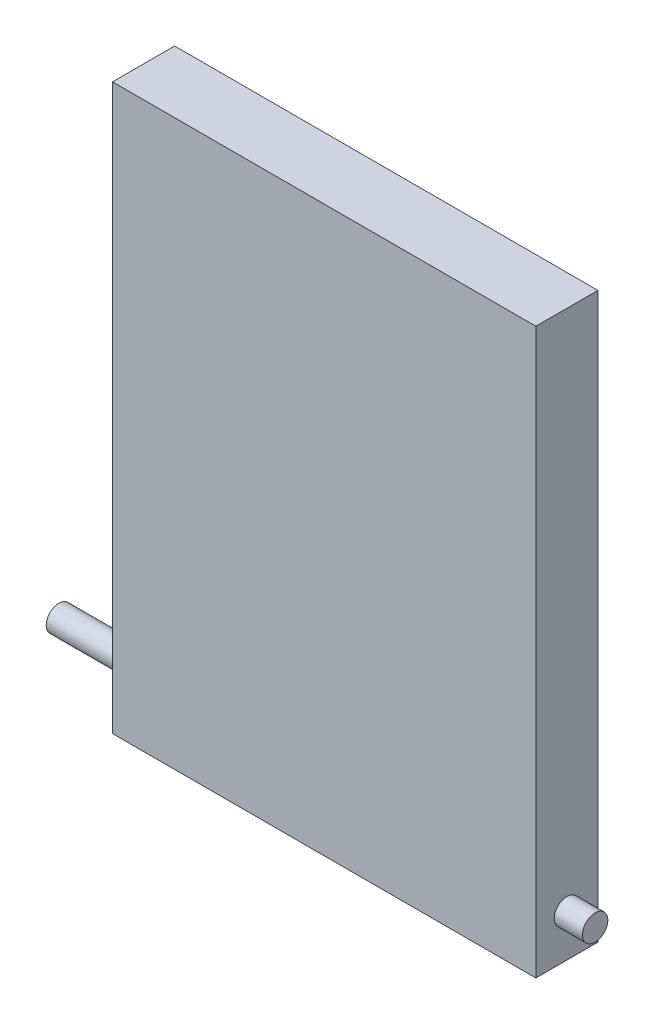
ISO-10303-21;
HEADER;
FILE_DESCRIPTION(('STEP AP214'),'2;1');
FILE_NAME('part.step','',(''),(''),'','','');
FILE_SCHEMA(('AUTOMOTIVE_DESIGN { 1 0 10303 214 1 1 1 1 }'));
ENDSEC;
DATA;
#1=APPLICATION_CONTEXT('core data for automotive mechanical design processes');
#2=APPLICATION_PROTOCOL_DEFINITION('international standard','automotive_design',2000,#1);
#3=PRODUCT_CONTEXT('',#1,'mechanical');
#4=PRODUCT('Part','Part','',(#3));
#5=PRODUCT_RELATED_PRODUCT_CATEGORY('part','',(#4));
#6=PRODUCT_DEFINITION_FORMATION('','',#4);
#7=PRODUCT_DEFINITION_CONTEXT('part definition',#1,'design');
#8=PRODUCT_DEFINITION('design','',#6,#7);
#9=PRODUCT_DEFINITION_SHAPE('','',#8);
#10=(LENGTH_UNIT() NAMED_UNIT(*) SI_UNIT(.MILLI.,.METRE.));
#11=(NAMED_UNIT(*) PLANE_ANGLE_UNIT() SI_UNIT($,.RADIAN.));
#12=(NAMED_UNIT(*) SI_UNIT($,.STERADIAN.) SOLID_ANGLE_UNIT());
#13=UNCERTAINTY_MEASURE_WITH_UNIT(LENGTH_MEASURE(1.E-05),#10,'distance_accuracy_value','');
#14=(GEOMETRIC_REPRESENTATION_CONTEXT(3) GLOBAL_UNCERTAINTY_ASSIGNED_CONTEXT((#13)) GLOBAL_UNIT_ASSIGNED_CONTEXT((#10,
#11,#12)) REPRESENTATION_CONTEXT('',''));
#15=CARTESIAN_POINT('',(0.,0.,0.));
#16=DIRECTION('',(0.,0.,1.));
#17=DIRECTION('',(1.,0.,0.));
#18=AXIS2_PLACEMENT_3D('',#15,#16,#17);
#19=CARTESIAN_POINT('',(0.,0.,22.));
#20=DIRECTION('',(1.,0.,0.));
#21=DIRECTION('',(0.,0.,-1.));
#22=AXIS2_PLACEMENT_3D('',#19,#20,#21);
#23=PLANE('',#22);
#24=CARTESIAN_POINT('',(0.,15.,11.));
#25=DIRECTION('',(1.,0.,0.));
#26=DIRECTION('',(0.,0.,-1.));
#27=AXIS2_PLACEMENT_3D('',#24,#25,#26);
#28=CIRCLE('',#27,4.5);
#29=CARTESIAN_POINT('',(0.,15.,6.5));
#30=VERTEX_POINT('',#29);
#31=EDGE_CURVE('E100',#30,#30,#28,.T.);
#32=ORIENTED_EDGE('',*,*,#31,.T.);
#33=EDGE_LOOP('',(#32));
#34=FACE_BOUND('',#33,.T.);
#35=DIRECTION('',(0.,-1.,0.));
#36=VECTOR('',#35,1.);
#37=CARTESIAN_POINT('',(0.,0.,0.));
#38=LINE('',#37,#36);
#39=CARTESIAN_POINT('',(0.,200.,0.));
#40=VERTEX_POINT('',#39);
#41=CARTESIAN_POINT('',(0.,0.,0.));
#42=VERTEX_POINT('',#41);
#43=EDGE_CURVE('E97',#40,#42,#38,.T.);
#44=ORIENTED_EDGE('',*,*,#43,.T.);
#45=DIRECTION('',(0.,0.,-1.));
#46=VECTOR('',#45,1.);
#47=CARTESIAN_POINT('',(0.,0.,22.));
#48=LINE('',#47,#46);
#49=CARTESIAN_POINT('',(0.,0.,22.));
#50=VERTEX_POINT('',#49);
#51=EDGE_CURVE('E11',#50,#42,#48,.T.);
#52=ORIENTED_EDGE('',*,*,#51,.F.);
#53=DIRECTION('',(0.,-1.,0.));
#54=VECTOR('',#53,1.);
#55=CARTESIAN_POINT('',(0.,0.,22.));
#56=LINE('',#55,#54);
#57=CARTESIAN_POINT('',(0.,200.,22.));
#58=VERTEX_POINT('',#57);
#59=EDGE_CURVE('E84',#58,#50,#56,.T.);
#60=ORIENTED_EDGE('',*,*,#59,.F.);
#61=DIRECTION('',(0.,0.,-1.));
#62=VECTOR('',#61,1.);
#63=CARTESIAN_POINT('',(0.,200.,22.));
#64=LINE('',#63,#62);
#65=EDGE_CURVE('E93',#58,#40,#64,.T.);
#66=ORIENTED_EDGE('',*,*,#65,.T.);
#67=EDGE_LOOP('',(#44,#52,#60,#66));
#68=FACE_BOUND('',#67,.T.);
#69=ADVANCED_FACE('F32',(#34,#68),#23,.F.);
#70=CARTESIAN_POINT('',(0.,0.,22.));
#71=DIRECTION('',(0.,1.,0.));
#72=DIRECTION('',(0.,0.,1.));
#73=AXIS2_PLACEMENT_3D('',#70,#71,#72);
#74=PLANE('',#73);
#75=DIRECTION('',(1.,0.,0.));
#76=VECTOR('',#75,1.);
#77=CARTESIAN_POINT('',(0.,0.,0.));
#78=LINE('',#77,#76);
#79=CARTESIAN_POINT('',(150.,0.,0.));
#80=VERTEX_POINT('',#79);
#81=EDGE_CURVE('E88',#42,#80,#78,.T.);
#82=ORIENTED_EDGE('',*,*,#81,.T.);
#83=DIRECTION('',(0.,0.,-1.));
#84=VECTOR('',#83,1.);
#85=CARTESIAN_POINT('',(150.,0.,22.));
#86=LINE('',#85,#84);
#87=CARTESIAN_POINT('',(150.,0.,22.));
#88=VERTEX_POINT('',#87);
#89=EDGE_CURVE('E41',#88,#80,#86,.T.);
#90=ORIENTED_EDGE('',*,*,#89,.F.);
#91=DIRECTION('',(1.,0.,0.));
#92=VECTOR('',#91,1.);
#93=CARTESIAN_POINT('',(0.,0.,22.));
#94=LINE('',#93,#92);
#95=EDGE_CURVE('E79',#50,#88,#94,.T.);
#96=ORIENTED_EDGE('',*,*,#95,.F.);
#97=ORIENTED_EDGE('',*,*,#51,.T.);
#98=EDGE_LOOP('',(#82,#90,#96,#97));
#99=FACE_BOUND('',#98,.T.);
#100=ADVANCED_FACE('F87',(#99),#74,.F.);
#101=CARTESIAN_POINT('',(150.,0.,22.));
#102=DIRECTION('',(-1.,0.,0.));
#103=DIRECTION('',(0.,0.,1.));
#104=AXIS2_PLACEMENT_3D('',#101,#102,#103);
#105=PLANE('',#104);
#106=CARTESIAN_POINT('',(150.,15.,11.));
#107=DIRECTION('',(-1.,0.,0.));
#108=DIRECTION('',(0.,0.,1.));
#109=AXIS2_PLACEMENT_3D('',#106,#107,#108);
#110=CIRCLE('',#109,4.5);
#111=CARTESIAN_POINT('',(150.,15.,15.5));
#112=VERTEX_POINT('',#111);
#113=EDGE_CURVE('E35',#112,#112,#110,.T.);
#114=ORIENTED_EDGE('',*,*,#113,.T.);
#115=EDGE_LOOP('',(#114));
#116=FACE_BOUND('',#115,.T.);
#117=DIRECTION('',(0.,1.,0.));
#118=VECTOR('',#117,1.);
#119=CARTESIAN_POINT('',(150.,0.,0.));
#120=LINE('',#119,#118);
#121=CARTESIAN_POINT('',(150.,200.,0.));
#122=VERTEX_POINT('',#121);
#123=EDGE_CURVE('E66',#80,#122,#120,.T.);
#124=ORIENTED_EDGE('',*,*,#123,.T.);
#125=DIRECTION('',(0.,0.,-1.));
#126=VECTOR('',#125,1.);
#127=CARTESIAN_POINT('',(150.,200.,22.));
#128=LINE('',#127,#126);
#129=CARTESIAN_POINT('',(150.,200.,22.));
#130=VERTEX_POINT('',#129);
#131=EDGE_CURVE('E89',#130,#122,#128,.T.);
#132=ORIENTED_EDGE('',*,*,#131,.F.);
#133=DIRECTION('',(0.,1.,0.));
#134=VECTOR('',#133,1.);
#135=CARTESIAN_POINT('',(150.,0.,22.));
#136=LINE('',#135,#134);
#137=EDGE_CURVE('E82',#88,#130,#136,.T.);
#138=ORIENTED_EDGE('',*,*,#137,.F.);
#139=ORIENTED_EDGE('',*,*,#89,.T.);
#140=EDGE_LOOP('',(#124,#132,#138,#139));
#141=FACE_BOUND('',#140,.T.);
#142=ADVANCED_FACE('F91',(#116,#141),#105,.F.);
#143=CARTESIAN_POINT('',(0.,200.,22.));
#144=DIRECTION('',(0.,-1.,0.));
#145=DIRECTION('',(0.,0.,-1.));
#146=AXIS2_PLACEMENT_3D('',#143,#144,#145);
#147=PLANE('',#146);
#148=DIRECTION('',(-1.,0.,0.));
#149=VECTOR('',#148,1.);
#150=CARTESIAN_POINT('',(0.,200.,0.));
#151=LINE('',#150,#149);
#152=EDGE_CURVE('E72',#122,#40,#151,.T.);
#153=ORIENTED_EDGE('',*,*,#152,.T.);
#154=ORIENTED_EDGE('',*,*,#65,.F.);
#155=DIRECTION('',(-1.,0.,0.));
#156=VECTOR('',#155,1.);
#157=CARTESIAN_POINT('',(0.,200.,22.));
#158=LINE('',#157,#156);
#159=EDGE_CURVE('E49',#130,#58,#158,.T.);
#160=ORIENTED_EDGE('',*,*,#159,.F.);
#161=ORIENTED_EDGE('',*,*,#131,.T.);
#162=EDGE_LOOP('',(#153,#154,#160,#161));
#163=FACE_BOUND('',#162,.T.);
#164=ADVANCED_FACE('F105',(#163),#147,.F.);
#165=CARTESIAN_POINT('',(0.,200.,22.));
#166=DIRECTION('',(0.,0.,-1.));
#167=DIRECTION('',(-1.,0.,0.));
#168=AXIS2_PLACEMENT_3D('',#165,#166,#167);
#169=PLANE('',#168);
#170=ORIENTED_EDGE('',*,*,#59,.T.);
#171=ORIENTED_EDGE('',*,*,#95,.T.);
#172=ORIENTED_EDGE('',*,*,#137,.T.);
#173=ORIENTED_EDGE('',*,*,#159,.T.);
#174=EDGE_LOOP('',(#170,#171,#172,#173));
#175=FACE_BOUND('',#174,.T.);
#176=ADVANCED_FACE('F80',(#175),#169,.F.);
#177=CARTESIAN_POINT('',(0.,200.,0.));
#178=DIRECTION('',(0.,0.,-1.));
#179=DIRECTION('',(-1.,0.,0.));
#180=AXIS2_PLACEMENT_3D('',#177,#178,#179);
#181=PLANE('',#180);
#182=ORIENTED_EDGE('',*,*,#43,.F.);
#183=ORIENTED_EDGE('',*,*,#152,.F.);
#184=ORIENTED_EDGE('',*,*,#123,.F.);
#185=ORIENTED_EDGE('',*,*,#81,.F.);
#186=EDGE_LOOP('',(#182,#183,#184,#185));
#187=FACE_BOUND('',#186,.T.);
#188=ADVANCED_FACE('F108',(#187),#181,.T.);
#189=CARTESIAN_POINT('',(160.,15.,11.));
#190=DIRECTION('',(-1.,0.,0.));
#191=DIRECTION('',(0.,0.,1.));
#192=AXIS2_PLACEMENT_3D('',#189,#190,#191);
#193=PLANE('',#192);
#194=CARTESIAN_POINT('',(160.,15.,11.));
#195=DIRECTION('',(-1.,0.,0.));
#196=DIRECTION('',(0.,0.,1.));
#197=AXIS2_PLACEMENT_3D('',#194,#195,#196);
#198=CIRCLE('',#197,4.5);
#199=CARTESIAN_POINT('',(160.,15.,15.5));
#200=VERTEX_POINT('',#199);
#201=EDGE_CURVE('E113',#200,#200,#198,.T.);
#202=ORIENTED_EDGE('',*,*,#201,.F.);
#203=EDGE_LOOP('',(#202));
#204=FACE_BOUND('',#203,.T.);
#205=ADVANCED_FACE('F143',(#204),#193,.F.);
#206=CARTESIAN_POINT('',(160.,15.,11.));
#207=DIRECTION('',(-1.,0.,0.));
#208=DIRECTION('',(0.,0.,1.));
#209=AXIS2_PLACEMENT_3D('',#206,#207,#208);
#210=CYLINDRICAL_SURFACE('',#209,4.5);
#211=ORIENTED_EDGE('',*,*,#201,.T.);
#212=EDGE_LOOP('',(#211));
#213=FACE_BOUND('',#212,.T.);
#214=ORIENTED_EDGE('',*,*,#113,.F.);
#215=EDGE_LOOP('',(#214));
#216=FACE_BOUND('',#215,.T.);
#217=ADVANCED_FACE('F125',(#213,#216),#210,.T.);
#218=CARTESIAN_POINT('',(-30.,15.,11.));
#219=DIRECTION('',(-1.,0.,0.));
#220=DIRECTION('',(0.,0.,1.));
#221=AXIS2_PLACEMENT_3D('',#218,#219,#220);
#222=CIRCLE('',#221,4.5);
#223=CARTESIAN_POINT('',(-30.,15.,15.5));
#224=VERTEX_POINT('',#223);
#225=EDGE_CURVE('E116',#224,#224,#222,.T.);
#226=ORIENTED_EDGE('',*,*,#225,.F.);
#227=EDGE_LOOP('',(#226));
#228=FACE_BOUND('',#227,.T.);
#229=ORIENTED_EDGE('',*,*,#31,.F.);
#230=EDGE_LOOP('',(#229));
#231=FACE_BOUND('',#230,.T.);
#232=ADVANCED_FACE('F122',(#228,#231),#210,.T.);
#233=CARTESIAN_POINT('',(-30.,15.,11.));
#234=DIRECTION('',(-1.,0.,0.));
#235=DIRECTION('',(0.,0.,1.));
#236=AXIS2_PLACEMENT_3D('',#233,#234,#235);
#237=PLANE('',#236);
#238=ORIENTED_EDGE('',*,*,#225,.T.);
#239=EDGE_LOOP('',(#238));
#240=FACE_BOUND('',#239,.T.);
#241=ADVANCED_FACE('F120',(#240),#237,.T.);
#242=CLOSED_SHELL('',(#69,#100,#142,#164,#176,#188,#205,#217,#232,#241));
#243=MANIFOLD_SOLID_BREP('B2',#242);
#244=ADVANCED_BREP_SHAPE_REPRESENTATION('',(#18,#243),#14);
#245=SHAPE_DEFINITION_REPRESENTATION(#9,#244);
ENDSEC;
END-ISO-10303-21;
